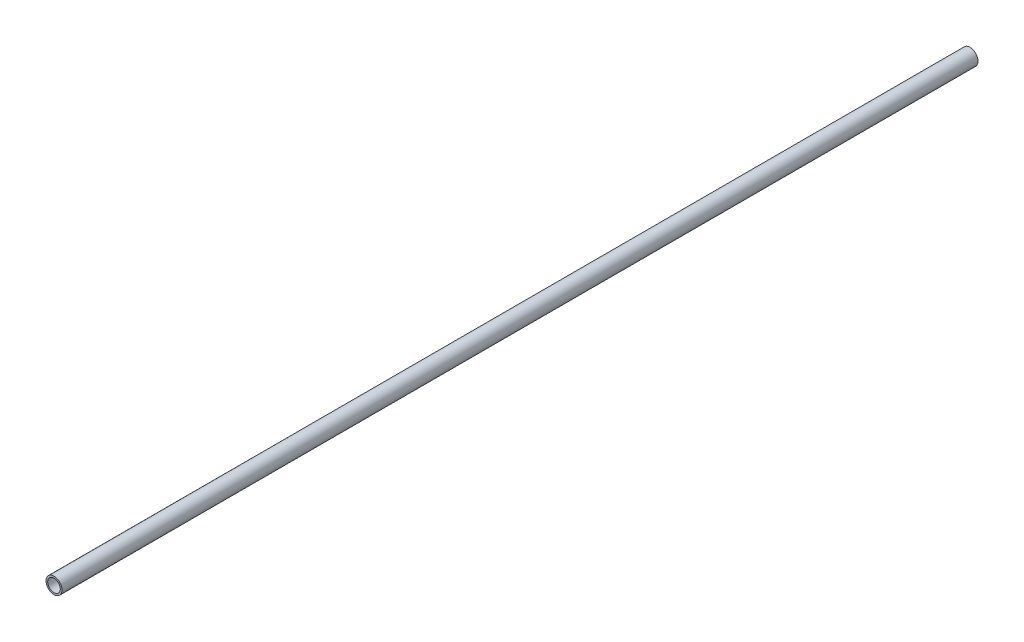
ISO-10303-21;
HEADER;
FILE_DESCRIPTION(('STEP AP214'),'2;1');
FILE_NAME('part.step','',(''),(''),'','','');
FILE_SCHEMA(('AUTOMOTIVE_DESIGN { 1 0 10303 214 1 1 1 1 }'));
ENDSEC;
DATA;
#1=APPLICATION_CONTEXT('core data for automotive mechanical design processes');
#2=APPLICATION_PROTOCOL_DEFINITION('international standard','automotive_design',2000,#1);
#3=PRODUCT_CONTEXT('',#1,'mechanical');
#4=PRODUCT('Part','Part','',(#3));
#5=PRODUCT_RELATED_PRODUCT_CATEGORY('part','',(#4));
#6=PRODUCT_DEFINITION_FORMATION('','',#4);
#7=PRODUCT_DEFINITION_CONTEXT('part definition',#1,'design');
#8=PRODUCT_DEFINITION('design','',#6,#7);
#9=PRODUCT_DEFINITION_SHAPE('','',#8);
#10=(LENGTH_UNIT() NAMED_UNIT(*) SI_UNIT(.MILLI.,.METRE.));
#11=(NAMED_UNIT(*) PLANE_ANGLE_UNIT() SI_UNIT($,.RADIAN.));
#12=(NAMED_UNIT(*) SI_UNIT($,.STERADIAN.) SOLID_ANGLE_UNIT());
#13=UNCERTAINTY_MEASURE_WITH_UNIT(LENGTH_MEASURE(1.E-05),#10,'distance_accuracy_value','');
#14=(GEOMETRIC_REPRESENTATION_CONTEXT(3) GLOBAL_UNCERTAINTY_ASSIGNED_CONTEXT((#13)) GLOBAL_UNIT_ASSIGNED_CONTEXT((#10,
#11,#12)) REPRESENTATION_CONTEXT('',''));
#15=CARTESIAN_POINT('',(0.,0.,0.));
#16=DIRECTION('',(0.,0.,1.));
#17=DIRECTION('',(1.,0.,0.));
#18=AXIS2_PLACEMENT_3D('',#15,#16,#17);
#19=CARTESIAN_POINT('',(0.,0.,762.));
#20=DIRECTION('',(0.,0.,1.));
#21=DIRECTION('',(1.,0.,0.));
#22=AXIS2_PLACEMENT_3D('',#19,#20,#21);
#23=PLANE('',#22);
#24=CARTESIAN_POINT('',(0.,0.,762.));
#25=DIRECTION('',(0.,0.,1.));
#26=DIRECTION('',(1.,0.,0.));
#27=AXIS2_PLACEMENT_3D('',#24,#25,#26);
#28=CIRCLE('',#27,13.335);
#29=CARTESIAN_POINT('',(13.335,0.,762.));
#30=VERTEX_POINT('',#29);
#31=EDGE_CURVE('E10',#30,#30,#28,.T.);
#32=ORIENTED_EDGE('',*,*,#31,.T.);
#33=EDGE_LOOP('',(#32));
#34=FACE_BOUND('',#33,.T.);
#35=CARTESIAN_POINT('',(0.,0.,762.));
#36=DIRECTION('',(0.,0.,1.));
#37=DIRECTION('',(1.,0.,0.));
#38=AXIS2_PLACEMENT_3D('',#35,#36,#37);
#39=CIRCLE('',#38,10.4648);
#40=CARTESIAN_POINT('',(10.4648,0.,762.));
#41=VERTEX_POINT('',#40);
#42=EDGE_CURVE('E47',#41,#41,#39,.T.);
#43=ORIENTED_EDGE('',*,*,#42,.F.);
#44=EDGE_LOOP('',(#43));
#45=FACE_BOUND('',#44,.T.);
#46=ADVANCED_FACE('F39',(#34,#45),#23,.T.);
#47=CARTESIAN_POINT('',(0.,0.,762.));
#48=DIRECTION('',(0.,0.,-1.));
#49=DIRECTION('',(-1.,0.,0.));
#50=AXIS2_PLACEMENT_3D('',#47,#48,#49);
#51=CYLINDRICAL_SURFACE('',#50,13.335);
#52=ORIENTED_EDGE('',*,*,#31,.F.);
#53=EDGE_LOOP('',(#52));
#54=FACE_BOUND('',#53,.T.);
#55=CARTESIAN_POINT('',(0.,0.,-762.));
#56=DIRECTION('',(0.,0.,1.));
#57=DIRECTION('',(1.,0.,0.));
#58=AXIS2_PLACEMENT_3D('',#55,#56,#57);
#59=CIRCLE('',#58,13.335);
#60=CARTESIAN_POINT('',(13.335,0.,-762.));
#61=VERTEX_POINT('',#60);
#62=EDGE_CURVE('E52',#61,#61,#59,.T.);
#63=ORIENTED_EDGE('',*,*,#62,.T.);
#64=EDGE_LOOP('',(#63));
#65=FACE_BOUND('',#64,.T.);
#66=ADVANCED_FACE('F41',(#54,#65),#51,.T.);
#67=CARTESIAN_POINT('',(0.,0.,762.));
#68=DIRECTION('',(0.,0.,-1.));
#69=DIRECTION('',(-1.,0.,0.));
#70=AXIS2_PLACEMENT_3D('',#67,#68,#69);
#71=CYLINDRICAL_SURFACE('',#70,10.4648);
#72=ORIENTED_EDGE('',*,*,#42,.T.);
#73=EDGE_LOOP('',(#72));
#74=FACE_BOUND('',#73,.T.);
#75=CARTESIAN_POINT('',(0.,0.,-762.));
#76=DIRECTION('',(0.,0.,1.));
#77=DIRECTION('',(1.,0.,0.));
#78=AXIS2_PLACEMENT_3D('',#75,#76,#77);
#79=CIRCLE('',#78,10.4648);
#80=CARTESIAN_POINT('',(10.4648,0.,-762.));
#81=VERTEX_POINT('',#80);
#82=EDGE_CURVE('E57',#81,#81,#79,.T.);
#83=ORIENTED_EDGE('',*,*,#82,.F.);
#84=EDGE_LOOP('',(#83));
#85=FACE_BOUND('',#84,.T.);
#86=ADVANCED_FACE('F67',(#74,#85),#71,.F.);
#87=CARTESIAN_POINT('',(0.,0.,-762.));
#88=DIRECTION('',(0.,0.,1.));
#89=DIRECTION('',(1.,0.,0.));
#90=AXIS2_PLACEMENT_3D('',#87,#88,#89);
#91=PLANE('',#90);
#92=ORIENTED_EDGE('',*,*,#82,.T.);
#93=EDGE_LOOP('',(#92));
#94=FACE_BOUND('',#93,.T.);
#95=ORIENTED_EDGE('',*,*,#62,.F.);
#96=EDGE_LOOP('',(#95));
#97=FACE_BOUND('',#96,.T.);
#98=ADVANCED_FACE('F64',(#94,#97),#91,.F.);
#99=CLOSED_SHELL('',(#46,#66,#86,#98));
#100=MANIFOLD_SOLID_BREP('B2',#99);
#101=ADVANCED_BREP_SHAPE_REPRESENTATION('',(#18,#100),#14);
#102=SHAPE_DEFINITION_REPRESENTATION(#9,#101);
ENDSEC;
END-ISO-10303-21;
